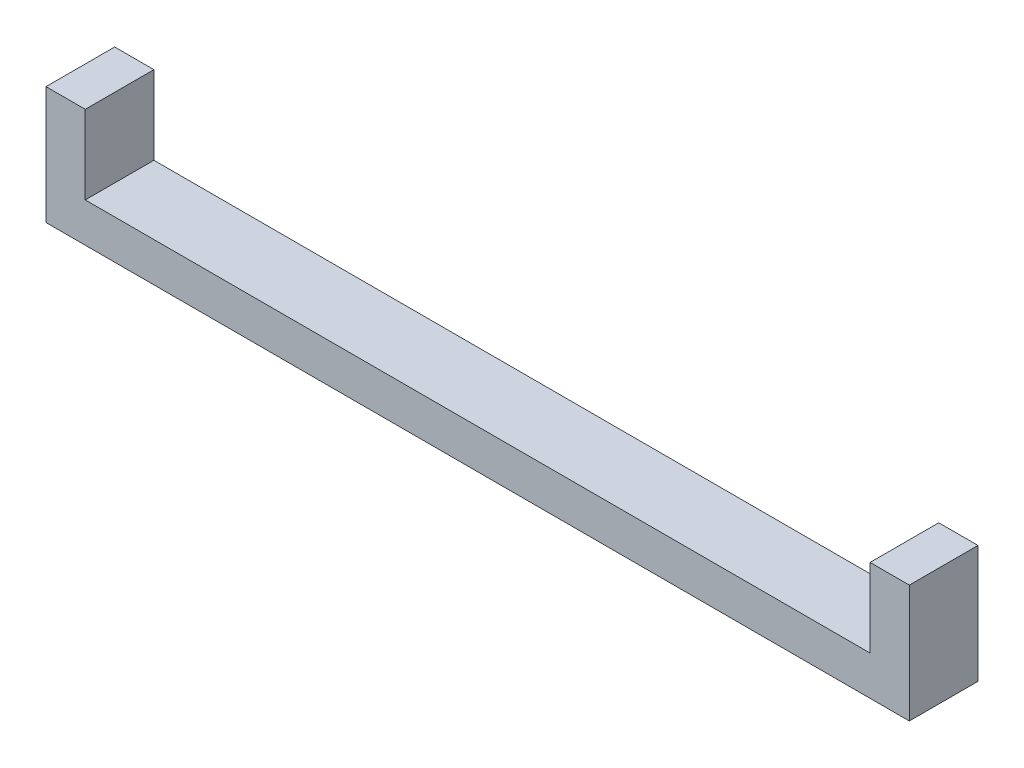
ISO-10303-21;
HEADER;
FILE_DESCRIPTION(('STEP AP214'),'2;1');
FILE_NAME('part.step','',(''),(''),'','','');
FILE_SCHEMA(('AUTOMOTIVE_DESIGN { 1 0 10303 214 1 1 1 1 }'));
ENDSEC;
DATA;
#1=APPLICATION_CONTEXT('core data for automotive mechanical design processes');
#2=APPLICATION_PROTOCOL_DEFINITION('international standard','automotive_design',2000,#1);
#3=PRODUCT_CONTEXT('',#1,'mechanical');
#4=PRODUCT('Part','Part','',(#3));
#5=PRODUCT_RELATED_PRODUCT_CATEGORY('part','',(#4));
#6=PRODUCT_DEFINITION_FORMATION('','',#4);
#7=PRODUCT_DEFINITION_CONTEXT('part definition',#1,'design');
#8=PRODUCT_DEFINITION('design','',#6,#7);
#9=PRODUCT_DEFINITION_SHAPE('','',#8);
#10=(LENGTH_UNIT() NAMED_UNIT(*) SI_UNIT(.MILLI.,.METRE.));
#11=(NAMED_UNIT(*) PLANE_ANGLE_UNIT() SI_UNIT($,.RADIAN.));
#12=(NAMED_UNIT(*) SI_UNIT($,.STERADIAN.) SOLID_ANGLE_UNIT());
#13=UNCERTAINTY_MEASURE_WITH_UNIT(LENGTH_MEASURE(1.E-05),#10,'distance_accuracy_value','');
#14=(GEOMETRIC_REPRESENTATION_CONTEXT(3) GLOBAL_UNCERTAINTY_ASSIGNED_CONTEXT((#13)) GLOBAL_UNIT_ASSIGNED_CONTEXT((#10,
#11,#12)) REPRESENTATION_CONTEXT('',''));
#15=CARTESIAN_POINT('',(0.,0.,0.));
#16=DIRECTION('',(0.,0.,1.));
#17=DIRECTION('',(1.,0.,0.));
#18=AXIS2_PLACEMENT_3D('',#15,#16,#17);
#19=CARTESIAN_POINT('',(220.,0.,17.5005));
#20=DIRECTION('',(-1.,0.,0.));
#21=DIRECTION('',(0.,0.,1.));
#22=AXIS2_PLACEMENT_3D('',#19,#20,#21);
#23=PLANE('',#22);
#24=DIRECTION('',(0.,1.,0.));
#25=VECTOR('',#24,1.);
#26=CARTESIAN_POINT('',(220.,0.,-17.5005));
#27=LINE('',#26,#25);
#28=CARTESIAN_POINT('',(220.,-20.,-17.5005));
#29=VERTEX_POINT('',#28);
#30=CARTESIAN_POINT('',(220.,40.,-17.5005));
#31=VERTEX_POINT('',#30);
#32=EDGE_CURVE('E114',#29,#31,#27,.T.);
#33=ORIENTED_EDGE('',*,*,#32,.T.);
#34=DIRECTION('',(0.,0.,-1.));
#35=VECTOR('',#34,1.);
#36=CARTESIAN_POINT('',(220.,40.,17.5005));
#37=LINE('',#36,#35);
#38=CARTESIAN_POINT('',(220.,40.,17.5005));
#39=VERTEX_POINT('',#38);
#40=EDGE_CURVE('E11',#39,#31,#37,.T.);
#41=ORIENTED_EDGE('',*,*,#40,.F.);
#42=DIRECTION('',(0.,1.,0.));
#43=VECTOR('',#42,1.);
#44=CARTESIAN_POINT('',(220.,0.,17.5005));
#45=LINE('',#44,#43);
#46=CARTESIAN_POINT('',(220.,-20.,17.5005));
#47=VERTEX_POINT('',#46);
#48=EDGE_CURVE('E78',#47,#39,#45,.T.);
#49=ORIENTED_EDGE('',*,*,#48,.F.);
#50=DIRECTION('',(0.,0.,-1.));
#51=VECTOR('',#50,1.);
#52=CARTESIAN_POINT('',(220.,-20.,17.5005));
#53=LINE('',#52,#51);
#54=EDGE_CURVE('E105',#47,#29,#53,.T.);
#55=ORIENTED_EDGE('',*,*,#54,.T.);
#56=EDGE_LOOP('',(#33,#41,#49,#55));
#57=FACE_BOUND('',#56,.T.);
#58=ADVANCED_FACE('F33',(#57),#23,.F.);
#59=CARTESIAN_POINT('',(200.,40.,17.5005));
#60=DIRECTION('',(0.,1.,0.));
#61=DIRECTION('',(0.,0.,1.));
#62=AXIS2_PLACEMENT_3D('',#59,#60,#61);
#63=PLANE('',#62);
#64=DIRECTION('',(1.,0.,0.));
#65=VECTOR('',#64,1.);
#66=CARTESIAN_POINT('',(200.,40.,-17.5005));
#67=LINE('',#66,#65);
#68=CARTESIAN_POINT('',(200.,40.,-17.5005));
#69=VERTEX_POINT('',#68);
#70=EDGE_CURVE('E149',#69,#31,#67,.T.);
#71=ORIENTED_EDGE('',*,*,#70,.F.);
#72=DIRECTION('',(0.,0.,-1.));
#73=VECTOR('',#72,1.);
#74=CARTESIAN_POINT('',(200.,40.,17.5005));
#75=LINE('',#74,#73);
#76=CARTESIAN_POINT('',(200.,40.,17.5005));
#77=VERTEX_POINT('',#76);
#78=EDGE_CURVE('E41',#77,#69,#75,.T.);
#79=ORIENTED_EDGE('',*,*,#78,.F.);
#80=DIRECTION('',(1.,0.,0.));
#81=VECTOR('',#80,1.);
#82=CARTESIAN_POINT('',(200.,40.,17.5005));
#83=LINE('',#82,#81);
#84=EDGE_CURVE('E140',#77,#39,#83,.T.);
#85=ORIENTED_EDGE('',*,*,#84,.T.);
#86=ORIENTED_EDGE('',*,*,#40,.T.);
#87=EDGE_LOOP('',(#71,#79,#85,#86));
#88=FACE_BOUND('',#87,.T.);
#89=ADVANCED_FACE('F165',(#88),#63,.T.);
#90=CARTESIAN_POINT('',(200.,0.,17.5005));
#91=DIRECTION('',(-1.,0.,0.));
#92=DIRECTION('',(0.,0.,1.));
#93=AXIS2_PLACEMENT_3D('',#90,#91,#92);
#94=PLANE('',#93);
#95=DIRECTION('',(0.,1.,0.));
#96=VECTOR('',#95,1.);
#97=CARTESIAN_POINT('',(200.,0.,-17.5005));
#98=LINE('',#97,#96);
#99=CARTESIAN_POINT('',(200.,0.,-17.5005));
#100=VERTEX_POINT('',#99);
#101=EDGE_CURVE('E152',#100,#69,#98,.T.);
#102=ORIENTED_EDGE('',*,*,#101,.F.);
#103=DIRECTION('',(0.,0.,-1.));
#104=VECTOR('',#103,1.);
#105=CARTESIAN_POINT('',(200.,0.,17.5005));
#106=LINE('',#105,#104);
#107=CARTESIAN_POINT('',(200.,0.,17.5005));
#108=VERTEX_POINT('',#107);
#109=EDGE_CURVE('E66',#108,#100,#106,.T.);
#110=ORIENTED_EDGE('',*,*,#109,.F.);
#111=DIRECTION('',(0.,1.,0.));
#112=VECTOR('',#111,1.);
#113=CARTESIAN_POINT('',(200.,0.,17.5005));
#114=LINE('',#113,#112);
#115=EDGE_CURVE('E143',#108,#77,#114,.T.);
#116=ORIENTED_EDGE('',*,*,#115,.T.);
#117=ORIENTED_EDGE('',*,*,#78,.T.);
#118=EDGE_LOOP('',(#102,#110,#116,#117));
#119=FACE_BOUND('',#118,.T.);
#120=ADVANCED_FACE('F162',(#119),#94,.T.);
#121=CARTESIAN_POINT('',(0.,0.,17.5005));
#122=DIRECTION('',(0.,1.,0.));
#123=DIRECTION('',(0.,0.,1.));
#124=AXIS2_PLACEMENT_3D('',#121,#122,#123);
#125=PLANE('',#124);
#126=DIRECTION('',(1.,0.,0.));
#127=VECTOR('',#126,1.);
#128=CARTESIAN_POINT('',(0.,0.,-17.5005));
#129=LINE('',#128,#127);
#130=CARTESIAN_POINT('',(-200.,0.,-17.5005));
#131=VERTEX_POINT('',#130);
#132=EDGE_CURVE('E155',#131,#100,#129,.T.);
#133=ORIENTED_EDGE('',*,*,#132,.F.);
#134=DIRECTION('',(0.,0.,-1.));
#135=VECTOR('',#134,1.);
#136=CARTESIAN_POINT('',(-200.,0.,17.5005));
#137=LINE('',#136,#135);
#138=CARTESIAN_POINT('',(-200.,0.,17.5005));
#139=VERTEX_POINT('',#138);
#140=EDGE_CURVE('E115',#139,#131,#137,.T.);
#141=ORIENTED_EDGE('',*,*,#140,.F.);
#142=DIRECTION('',(1.,0.,0.));
#143=VECTOR('',#142,1.);
#144=CARTESIAN_POINT('',(0.,0.,17.5005));
#145=LINE('',#144,#143);
#146=EDGE_CURVE('E106',#139,#108,#145,.T.);
#147=ORIENTED_EDGE('',*,*,#146,.T.);
#148=ORIENTED_EDGE('',*,*,#109,.T.);
#149=EDGE_LOOP('',(#133,#141,#147,#148));
#150=FACE_BOUND('',#149,.T.);
#151=ADVANCED_FACE('F172',(#150),#125,.T.);
#152=CARTESIAN_POINT('',(0.,-20.,17.5005));
#153=DIRECTION('',(0.,1.,0.));
#154=DIRECTION('',(0.,0.,1.));
#155=AXIS2_PLACEMENT_3D('',#152,#153,#154);
#156=PLANE('',#155);
#157=DIRECTION('',(1.,0.,0.));
#158=VECTOR('',#157,1.);
#159=CARTESIAN_POINT('',(0.,-20.,-17.5005));
#160=LINE('',#159,#158);
#161=CARTESIAN_POINT('',(-220.,-20.,-17.5005));
#162=VERTEX_POINT('',#161);
#163=EDGE_CURVE('E73',#162,#29,#160,.T.);
#164=ORIENTED_EDGE('',*,*,#163,.T.);
#165=ORIENTED_EDGE('',*,*,#54,.F.);
#166=DIRECTION('',(1.,0.,0.));
#167=VECTOR('',#166,1.);
#168=CARTESIAN_POINT('',(0.,-20.,17.5005));
#169=LINE('',#168,#167);
#170=CARTESIAN_POINT('',(-220.,-20.,17.5005));
#171=VERTEX_POINT('',#170);
#172=EDGE_CURVE('E49',#171,#47,#169,.T.);
#173=ORIENTED_EDGE('',*,*,#172,.F.);
#174=DIRECTION('',(0.,0.,-1.));
#175=VECTOR('',#174,1.);
#176=CARTESIAN_POINT('',(-220.,-20.,17.5005));
#177=LINE('',#176,#175);
#178=EDGE_CURVE('E103',#171,#162,#177,.T.);
#179=ORIENTED_EDGE('',*,*,#178,.T.);
#180=EDGE_LOOP('',(#164,#165,#173,#179));
#181=FACE_BOUND('',#180,.T.);
#182=ADVANCED_FACE('F102',(#181),#156,.F.);
#183=CARTESIAN_POINT('',(0.,0.,17.5005));
#184=DIRECTION('',(0.,0.,-1.));
#185=DIRECTION('',(-1.,0.,0.));
#186=AXIS2_PLACEMENT_3D('',#183,#184,#185);
#187=PLANE('',#186);
#188=ORIENTED_EDGE('',*,*,#48,.T.);
#189=ORIENTED_EDGE('',*,*,#84,.F.);
#190=ORIENTED_EDGE('',*,*,#115,.F.);
#191=ORIENTED_EDGE('',*,*,#146,.F.);
#192=DIRECTION('',(0.,1.,0.));
#193=VECTOR('',#192,1.);
#194=CARTESIAN_POINT('',(-200.,0.,17.5005));
#195=LINE('',#194,#193);
#196=CARTESIAN_POINT('',(-200.,40.,17.5005));
#197=VERTEX_POINT('',#196);
#198=EDGE_CURVE('E121',#139,#197,#195,.T.);
#199=ORIENTED_EDGE('',*,*,#198,.T.);
#200=DIRECTION('',(-1.,0.,0.));
#201=VECTOR('',#200,1.);
#202=CARTESIAN_POINT('',(-200.,40.,17.5005));
#203=LINE('',#202,#201);
#204=CARTESIAN_POINT('',(-220.,40.,17.5005));
#205=VERTEX_POINT('',#204);
#206=EDGE_CURVE('E119',#197,#205,#203,.T.);
#207=ORIENTED_EDGE('',*,*,#206,.T.);
#208=DIRECTION('',(0.,1.,0.));
#209=VECTOR('',#208,1.);
#210=CARTESIAN_POINT('',(-220.,0.,17.5005));
#211=LINE('',#210,#209);
#212=EDGE_CURVE('E111',#171,#205,#211,.T.);
#213=ORIENTED_EDGE('',*,*,#212,.F.);
#214=ORIENTED_EDGE('',*,*,#172,.T.);
#215=EDGE_LOOP('',(#188,#189,#190,#191,#199,#207,#213,#214));
#216=FACE_BOUND('',#215,.T.);
#217=ADVANCED_FACE('F117',(#216),#187,.F.);
#218=CARTESIAN_POINT('',(0.,0.,-17.5005));
#219=DIRECTION('',(0.,0.,-1.));
#220=DIRECTION('',(-1.,0.,0.));
#221=AXIS2_PLACEMENT_3D('',#218,#219,#220);
#222=PLANE('',#221);
#223=ORIENTED_EDGE('',*,*,#32,.F.);
#224=ORIENTED_EDGE('',*,*,#163,.F.);
#225=DIRECTION('',(0.,1.,0.));
#226=VECTOR('',#225,1.);
#227=CARTESIAN_POINT('',(-220.,0.,-17.5005));
#228=LINE('',#227,#226);
#229=CARTESIAN_POINT('',(-220.,40.,-17.5005));
#230=VERTEX_POINT('',#229);
#231=EDGE_CURVE('E113',#162,#230,#228,.T.);
#232=ORIENTED_EDGE('',*,*,#231,.T.);
#233=DIRECTION('',(-1.,0.,0.));
#234=VECTOR('',#233,1.);
#235=CARTESIAN_POINT('',(-200.,40.,-17.5005));
#236=LINE('',#235,#234);
#237=CARTESIAN_POINT('',(-200.,40.,-17.5005));
#238=VERTEX_POINT('',#237);
#239=EDGE_CURVE('E122',#238,#230,#236,.T.);
#240=ORIENTED_EDGE('',*,*,#239,.F.);
#241=DIRECTION('',(0.,1.,0.));
#242=VECTOR('',#241,1.);
#243=CARTESIAN_POINT('',(-200.,0.,-17.5005));
#244=LINE('',#243,#242);
#245=EDGE_CURVE('E126',#131,#238,#244,.T.);
#246=ORIENTED_EDGE('',*,*,#245,.F.);
#247=ORIENTED_EDGE('',*,*,#132,.T.);
#248=ORIENTED_EDGE('',*,*,#101,.T.);
#249=ORIENTED_EDGE('',*,*,#70,.T.);
#250=EDGE_LOOP('',(#223,#224,#232,#240,#246,#247,#248,#249));
#251=FACE_BOUND('',#250,.T.);
#252=ADVANCED_FACE('F168',(#251),#222,.T.);
#253=CARTESIAN_POINT('',(-220.,0.,17.5005));
#254=DIRECTION('',(-1.,0.,0.));
#255=DIRECTION('',(0.,0.,1.));
#256=AXIS2_PLACEMENT_3D('',#253,#254,#255);
#257=PLANE('',#256);
#258=ORIENTED_EDGE('',*,*,#231,.F.);
#259=ORIENTED_EDGE('',*,*,#178,.F.);
#260=ORIENTED_EDGE('',*,*,#212,.T.);
#261=DIRECTION('',(0.,0.,-1.));
#262=VECTOR('',#261,1.);
#263=CARTESIAN_POINT('',(-220.,40.,17.5005));
#264=LINE('',#263,#262);
#265=EDGE_CURVE('E130',#205,#230,#264,.T.);
#266=ORIENTED_EDGE('',*,*,#265,.T.);
#267=EDGE_LOOP('',(#258,#259,#260,#266));
#268=FACE_BOUND('',#267,.T.);
#269=ADVANCED_FACE('F110',(#268),#257,.T.);
#270=CARTESIAN_POINT('',(-200.,0.,17.5005));
#271=DIRECTION('',(-1.,0.,0.));
#272=DIRECTION('',(0.,0.,1.));
#273=AXIS2_PLACEMENT_3D('',#270,#271,#272);
#274=PLANE('',#273);
#275=ORIENTED_EDGE('',*,*,#245,.T.);
#276=DIRECTION('',(0.,0.,-1.));
#277=VECTOR('',#276,1.);
#278=CARTESIAN_POINT('',(-200.,40.,17.5005));
#279=LINE('',#278,#277);
#280=EDGE_CURVE('E134',#197,#238,#279,.T.);
#281=ORIENTED_EDGE('',*,*,#280,.F.);
#282=ORIENTED_EDGE('',*,*,#198,.F.);
#283=ORIENTED_EDGE('',*,*,#140,.T.);
#284=EDGE_LOOP('',(#275,#281,#282,#283));
#285=FACE_BOUND('',#284,.T.);
#286=ADVANCED_FACE('F175',(#285),#274,.F.);
#287=CARTESIAN_POINT('',(-200.,40.,17.5005));
#288=DIRECTION('',(0.,-1.,0.));
#289=DIRECTION('',(0.,0.,-1.));
#290=AXIS2_PLACEMENT_3D('',#287,#288,#289);
#291=PLANE('',#290);
#292=ORIENTED_EDGE('',*,*,#239,.T.);
#293=ORIENTED_EDGE('',*,*,#265,.F.);
#294=ORIENTED_EDGE('',*,*,#206,.F.);
#295=ORIENTED_EDGE('',*,*,#280,.T.);
#296=EDGE_LOOP('',(#292,#293,#294,#295));
#297=FACE_BOUND('',#296,.T.);
#298=ADVANCED_FACE('F178',(#297),#291,.F.);
#299=CLOSED_SHELL('',(#58,#89,#120,#151,#182,#217,#252,#269,#286,#298));
#300=MANIFOLD_SOLID_BREP('B2',#299);
#301=ADVANCED_BREP_SHAPE_REPRESENTATION('',(#18,#300),#14);
#302=SHAPE_DEFINITION_REPRESENTATION(#9,#301);
ENDSEC;
END-ISO-10303-21;
